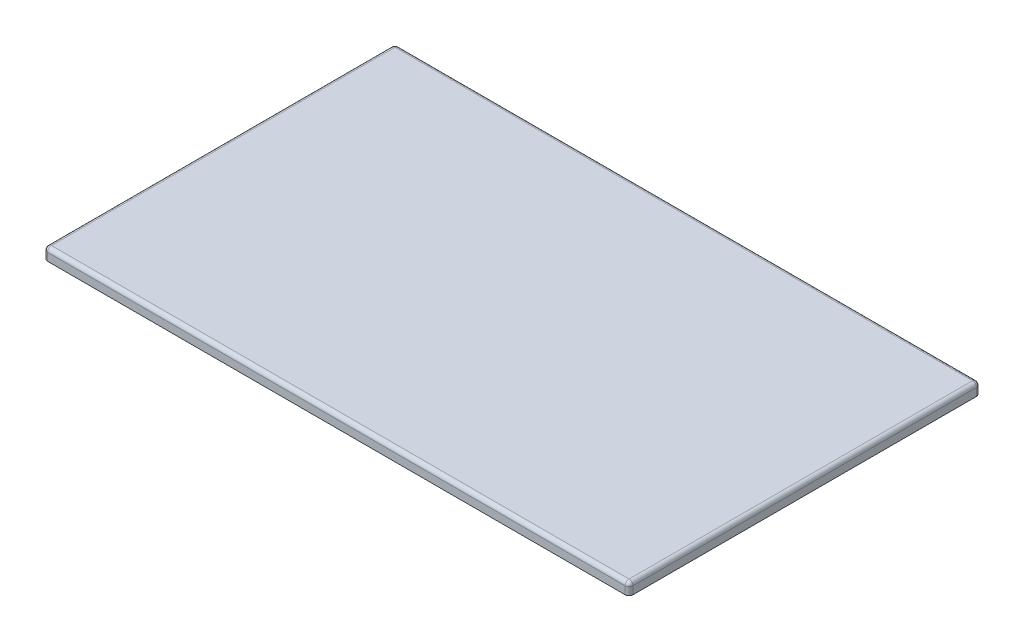
ISO-10303-21;
HEADER;
FILE_DESCRIPTION(('STEP AP214'),'2;1');
FILE_NAME('part.step','',(''),(''),'','','');
FILE_SCHEMA(('AUTOMOTIVE_DESIGN { 1 0 10303 214 1 1 1 1 }'));
ENDSEC;
DATA;
#1=APPLICATION_CONTEXT('core data for automotive mechanical design processes');
#2=APPLICATION_PROTOCOL_DEFINITION('international standard','automotive_design',2000,#1);
#3=PRODUCT_CONTEXT('',#1,'mechanical');
#4=PRODUCT('Part','Part','',(#3));
#5=PRODUCT_RELATED_PRODUCT_CATEGORY('part','',(#4));
#6=PRODUCT_DEFINITION_FORMATION('','',#4);
#7=PRODUCT_DEFINITION_CONTEXT('part definition',#1,'design');
#8=PRODUCT_DEFINITION('design','',#6,#7);
#9=PRODUCT_DEFINITION_SHAPE('','',#8);
#10=(LENGTH_UNIT() NAMED_UNIT(*) SI_UNIT(.MILLI.,.METRE.));
#11=(NAMED_UNIT(*) PLANE_ANGLE_UNIT() SI_UNIT($,.RADIAN.));
#12=(NAMED_UNIT(*) SI_UNIT($,.STERADIAN.) SOLID_ANGLE_UNIT());
#13=UNCERTAINTY_MEASURE_WITH_UNIT(LENGTH_MEASURE(1.E-05),#10,'distance_accuracy_value','');
#14=(GEOMETRIC_REPRESENTATION_CONTEXT(3) GLOBAL_UNCERTAINTY_ASSIGNED_CONTEXT((#13)) GLOBAL_UNIT_ASSIGNED_CONTEXT((#10,
#11,#12)) REPRESENTATION_CONTEXT('',''));
#15=CARTESIAN_POINT('',(0.,0.,0.));
#16=DIRECTION('',(0.,0.,1.));
#17=DIRECTION('',(1.,0.,0.));
#18=AXIS2_PLACEMENT_3D('',#15,#16,#17);
#19=CARTESIAN_POINT('',(0.,30.,0.));
#20=DIRECTION('',(1.,0.,0.));
#21=DIRECTION('',(0.,0.,-1.));
#22=AXIS2_PLACEMENT_3D('',#19,#20,#21);
#23=PLANE('',#22);
#24=DIRECTION('',(0.,0.,1.));
#25=VECTOR('',#24,1.);
#26=CARTESIAN_POINT('',(0.,20.,0.));
#27=LINE('',#26,#25);
#28=CARTESIAN_POINT('',(0.,20.,-10.));
#29=VERTEX_POINT('',#28);
#30=CARTESIAN_POINT('',(0.,20.,-890.));
#31=VERTEX_POINT('',#30);
#32=EDGE_CURVE('E442',#29,#31,#27,.F.);
#33=ORIENTED_EDGE('',*,*,#32,.T.);
#34=DIRECTION('',(0.,-1.,0.));
#35=VECTOR('',#34,1.);
#36=CARTESIAN_POINT('',(0.,30.,-890.));
#37=LINE('',#36,#35);
#38=CARTESIAN_POINT('',(0.,0.,-890.));
#39=VERTEX_POINT('',#38);
#40=EDGE_CURVE('E477',#31,#39,#37,.T.);
#41=ORIENTED_EDGE('',*,*,#40,.T.);
#42=DIRECTION('',(0.,0.,1.));
#43=VECTOR('',#42,1.);
#44=CARTESIAN_POINT('',(0.,0.,0.));
#45=LINE('',#44,#43);
#46=CARTESIAN_POINT('',(0.,0.,-10.));
#47=VERTEX_POINT('',#46);
#48=EDGE_CURVE('E397',#39,#47,#45,.T.);
#49=ORIENTED_EDGE('',*,*,#48,.T.);
#50=DIRECTION('',(0.,-1.,0.));
#51=VECTOR('',#50,1.);
#52=CARTESIAN_POINT('',(0.,30.,-10.));
#53=LINE('',#52,#51);
#54=EDGE_CURVE('E474',#47,#29,#53,.F.);
#55=ORIENTED_EDGE('',*,*,#54,.T.);
#56=EDGE_LOOP('',(#33,#41,#49,#55));
#57=FACE_BOUND('',#56,.T.);
#58=ADVANCED_FACE('F40',(#57),#23,.F.);
#59=CARTESIAN_POINT('',(0.,30.,0.));
#60=DIRECTION('',(0.,0.,-1.));
#61=DIRECTION('',(-1.,0.,0.));
#62=AXIS2_PLACEMENT_3D('',#59,#60,#61);
#63=PLANE('',#62);
#64=DIRECTION('',(1.,0.,0.));
#65=VECTOR('',#64,1.);
#66=CARTESIAN_POINT('',(0.,0.,0.));
#67=LINE('',#66,#65);
#68=CARTESIAN_POINT('',(10.,0.,0.));
#69=VERTEX_POINT('',#68);
#70=CARTESIAN_POINT('',(1490.,0.,0.));
#71=VERTEX_POINT('',#70);
#72=EDGE_CURVE('E401',#69,#71,#67,.T.);
#73=ORIENTED_EDGE('',*,*,#72,.T.);
#74=DIRECTION('',(0.,-1.,0.));
#75=VECTOR('',#74,1.);
#76=CARTESIAN_POINT('',(1490.,30.,0.));
#77=LINE('',#76,#75);
#78=CARTESIAN_POINT('',(1490.,20.,0.));
#79=VERTEX_POINT('',#78);
#80=EDGE_CURVE('E11',#71,#79,#77,.F.);
#81=ORIENTED_EDGE('',*,*,#80,.T.);
#82=DIRECTION('',(1.,0.,0.));
#83=VECTOR('',#82,1.);
#84=CARTESIAN_POINT('',(0.,20.,0.));
#85=LINE('',#84,#83);
#86=CARTESIAN_POINT('',(10.,20.,0.));
#87=VERTEX_POINT('',#86);
#88=EDGE_CURVE('E438',#79,#87,#85,.F.);
#89=ORIENTED_EDGE('',*,*,#88,.T.);
#90=DIRECTION('',(0.,-1.,0.));
#91=VECTOR('',#90,1.);
#92=CARTESIAN_POINT('',(10.,30.,0.));
#93=LINE('',#92,#91);
#94=EDGE_CURVE('E50',#87,#69,#93,.T.);
#95=ORIENTED_EDGE('',*,*,#94,.T.);
#96=EDGE_LOOP('',(#73,#81,#89,#95));
#97=FACE_BOUND('',#96,.T.);
#98=ADVANCED_FACE('F530',(#97),#63,.F.);
#99=CARTESIAN_POINT('',(1500.,30.,0.));
#100=DIRECTION('',(-1.,0.,0.));
#101=DIRECTION('',(0.,0.,1.));
#102=AXIS2_PLACEMENT_3D('',#99,#100,#101);
#103=PLANE('',#102);
#104=DIRECTION('',(0.,0.,-1.));
#105=VECTOR('',#104,1.);
#106=CARTESIAN_POINT('',(1500.,0.,0.));
#107=LINE('',#106,#105);
#108=CARTESIAN_POINT('',(1500.,0.,-10.));
#109=VERTEX_POINT('',#108);
#110=CARTESIAN_POINT('',(1500.,0.,-890.));
#111=VERTEX_POINT('',#110);
#112=EDGE_CURVE('E406',#109,#111,#107,.T.);
#113=ORIENTED_EDGE('',*,*,#112,.T.);
#114=DIRECTION('',(0.,-1.,0.));
#115=VECTOR('',#114,1.);
#116=CARTESIAN_POINT('',(1500.,30.,-890.));
#117=LINE('',#116,#115);
#118=CARTESIAN_POINT('',(1500.,20.,-890.));
#119=VERTEX_POINT('',#118);
#120=EDGE_CURVE('E501',#111,#119,#117,.F.);
#121=ORIENTED_EDGE('',*,*,#120,.T.);
#122=DIRECTION('',(0.,0.,-1.));
#123=VECTOR('',#122,1.);
#124=CARTESIAN_POINT('',(1500.,20.,0.));
#125=LINE('',#124,#123);
#126=CARTESIAN_POINT('',(1500.,20.,-10.));
#127=VERTEX_POINT('',#126);
#128=EDGE_CURVE('E434',#119,#127,#125,.F.);
#129=ORIENTED_EDGE('',*,*,#128,.T.);
#130=DIRECTION('',(0.,-1.,0.));
#131=VECTOR('',#130,1.);
#132=CARTESIAN_POINT('',(1500.,30.,-10.));
#133=LINE('',#132,#131);
#134=EDGE_CURVE('E498',#127,#109,#133,.T.);
#135=ORIENTED_EDGE('',*,*,#134,.T.);
#136=EDGE_LOOP('',(#113,#121,#129,#135));
#137=FACE_BOUND('',#136,.T.);
#138=ADVANCED_FACE('F550',(#137),#103,.F.);
#139=CARTESIAN_POINT('',(0.,30.,-900.));
#140=DIRECTION('',(0.,0.,1.));
#141=DIRECTION('',(1.,0.,0.));
#142=AXIS2_PLACEMENT_3D('',#139,#140,#141);
#143=PLANE('',#142);
#144=DIRECTION('',(-1.,0.,0.));
#145=VECTOR('',#144,1.);
#146=CARTESIAN_POINT('',(0.,0.,-900.));
#147=LINE('',#146,#145);
#148=CARTESIAN_POINT('',(1490.,0.,-900.));
#149=VERTEX_POINT('',#148);
#150=CARTESIAN_POINT('',(10.,0.,-900.));
#151=VERTEX_POINT('',#150);
#152=EDGE_CURVE('E410',#149,#151,#147,.T.);
#153=ORIENTED_EDGE('',*,*,#152,.T.);
#154=DIRECTION('',(0.,-1.,0.));
#155=VECTOR('',#154,1.);
#156=CARTESIAN_POINT('',(10.,30.,-900.));
#157=LINE('',#156,#155);
#158=CARTESIAN_POINT('',(10.,20.,-900.));
#159=VERTEX_POINT('',#158);
#160=EDGE_CURVE('E495',#151,#159,#157,.F.);
#161=ORIENTED_EDGE('',*,*,#160,.T.);
#162=DIRECTION('',(-1.,0.,0.));
#163=VECTOR('',#162,1.);
#164=CARTESIAN_POINT('',(0.,20.,-900.));
#165=LINE('',#164,#163);
#166=CARTESIAN_POINT('',(1490.,20.,-900.));
#167=VERTEX_POINT('',#166);
#168=EDGE_CURVE('E430',#159,#167,#165,.F.);
#169=ORIENTED_EDGE('',*,*,#168,.T.);
#170=DIRECTION('',(0.,-1.,0.));
#171=VECTOR('',#170,1.);
#172=CARTESIAN_POINT('',(1490.,30.,-900.));
#173=LINE('',#172,#171);
#174=EDGE_CURVE('E492',#167,#149,#173,.T.);
#175=ORIENTED_EDGE('',*,*,#174,.T.);
#176=EDGE_LOOP('',(#153,#161,#169,#175));
#177=FACE_BOUND('',#176,.T.);
#178=ADVANCED_FACE('F613',(#177),#143,.F.);
#179=CARTESIAN_POINT('',(0.,30.,0.));
#180=DIRECTION('',(0.,-1.,0.));
#181=DIRECTION('',(0.,0.,-1.));
#182=AXIS2_PLACEMENT_3D('',#179,#180,#181);
#183=PLANE('',#182);
#184=DIRECTION('',(0.,0.,-1.));
#185=VECTOR('',#184,1.);
#186=CARTESIAN_POINT('',(1490.,30.,0.));
#187=LINE('',#186,#185);
#188=CARTESIAN_POINT('',(1490.,30.,-10.));
#189=VERTEX_POINT('',#188);
#190=CARTESIAN_POINT('',(1490.,30.,-890.));
#191=VERTEX_POINT('',#190);
#192=EDGE_CURVE('E422',#189,#191,#187,.T.);
#193=ORIENTED_EDGE('',*,*,#192,.T.);
#194=DIRECTION('',(-1.,0.,0.));
#195=VECTOR('',#194,1.);
#196=CARTESIAN_POINT('',(0.,30.,-890.));
#197=LINE('',#196,#195);
#198=CARTESIAN_POINT('',(10.,30.,-890.));
#199=VERTEX_POINT('',#198);
#200=EDGE_CURVE('E426',#191,#199,#197,.T.);
#201=ORIENTED_EDGE('',*,*,#200,.T.);
#202=DIRECTION('',(0.,0.,1.));
#203=VECTOR('',#202,1.);
#204=CARTESIAN_POINT('',(10.,30.,0.));
#205=LINE('',#204,#203);
#206=CARTESIAN_POINT('',(10.,30.,-10.));
#207=VERTEX_POINT('',#206);
#208=EDGE_CURVE('E414',#199,#207,#205,.T.);
#209=ORIENTED_EDGE('',*,*,#208,.T.);
#210=DIRECTION('',(1.,0.,0.));
#211=VECTOR('',#210,1.);
#212=CARTESIAN_POINT('',(0.,30.,-10.));
#213=LINE('',#212,#211);
#214=EDGE_CURVE('E418',#207,#189,#213,.T.);
#215=ORIENTED_EDGE('',*,*,#214,.T.);
#216=EDGE_LOOP('',(#193,#201,#209,#215));
#217=FACE_BOUND('',#216,.T.);
#218=ADVANCED_FACE('F562',(#217),#183,.F.);
#219=CARTESIAN_POINT('',(0.,0.,0.));
#220=DIRECTION('',(0.,-1.,0.));
#221=DIRECTION('',(0.,0.,-1.));
#222=AXIS2_PLACEMENT_3D('',#219,#220,#221);
#223=PLANE('',#222);
#224=CARTESIAN_POINT('',(100.,0.,-800.));
#225=DIRECTION('',(0.,-1.,0.));
#226=DIRECTION('',(0.,0.,1.));
#227=AXIS2_PLACEMENT_3D('',#224,#225,#226);
#228=CIRCLE('',#227,10.);
#229=CARTESIAN_POINT('',(100.,0.,-790.));
#230=VERTEX_POINT('',#229);
#231=CARTESIAN_POINT('',(100.,0.,-810.));
#232=VERTEX_POINT('',#231);
#233=EDGE_CURVE('E58',#230,#232,#228,.T.);
#234=ORIENTED_EDGE('',*,*,#233,.F.);
#235=DIRECTION('',(-1.,0.,0.));
#236=VECTOR('',#235,1.);
#237=CARTESIAN_POINT('',(100.,0.,-790.));
#238=LINE('',#237,#236);
#239=CARTESIAN_POINT('',(150.,0.,-790.));
#240=VERTEX_POINT('',#239);
#241=EDGE_CURVE('E318',#240,#230,#238,.T.);
#242=ORIENTED_EDGE('',*,*,#241,.F.);
#243=CARTESIAN_POINT('',(150.,0.,-800.));
#244=DIRECTION('',(0.,-1.,0.));
#245=DIRECTION('',(0.,0.,1.));
#246=AXIS2_PLACEMENT_3D('',#243,#244,#245);
#247=CIRCLE('',#246,10.);
#248=CARTESIAN_POINT('',(150.,0.,-810.));
#249=VERTEX_POINT('',#248);
#250=EDGE_CURVE('E337',#249,#240,#247,.T.);
#251=ORIENTED_EDGE('',*,*,#250,.F.);
#252=DIRECTION('',(1.,0.,0.));
#253=VECTOR('',#252,1.);
#254=CARTESIAN_POINT('',(100.,0.,-810.));
#255=LINE('',#254,#253);
#256=EDGE_CURVE('E333',#232,#249,#255,.T.);
#257=ORIENTED_EDGE('',*,*,#256,.F.);
#258=EDGE_LOOP('',(#234,#242,#251,#257));
#259=FACE_BOUND('',#258,.T.);
#260=CARTESIAN_POINT('',(1400.,0.,-800.));
#261=DIRECTION('',(0.,-1.,0.));
#262=DIRECTION('',(0.,0.,-1.));
#263=AXIS2_PLACEMENT_3D('',#260,#261,#262);
#264=CIRCLE('',#263,10.);
#265=CARTESIAN_POINT('',(1400.,0.,-810.));
#266=VERTEX_POINT('',#265);
#267=CARTESIAN_POINT('',(1400.,0.,-790.));
#268=VERTEX_POINT('',#267);
#269=EDGE_CURVE('E66',#266,#268,#264,.T.);
#270=ORIENTED_EDGE('',*,*,#269,.F.);
#271=DIRECTION('',(1.,0.,0.));
#272=VECTOR('',#271,1.);
#273=CARTESIAN_POINT('',(1400.,0.,-810.));
#274=LINE('',#273,#272);
#275=CARTESIAN_POINT('',(1350.,0.,-810.));
#276=VERTEX_POINT('',#275);
#277=EDGE_CURVE('E276',#276,#266,#274,.T.);
#278=ORIENTED_EDGE('',*,*,#277,.F.);
#279=CARTESIAN_POINT('',(1350.,0.,-800.));
#280=DIRECTION('',(0.,-1.,0.));
#281=DIRECTION('',(0.,0.,-1.));
#282=AXIS2_PLACEMENT_3D('',#279,#280,#281);
#283=CIRCLE('',#282,10.);
#284=CARTESIAN_POINT('',(1350.,0.,-790.));
#285=VERTEX_POINT('',#284);
#286=EDGE_CURVE('E296',#285,#276,#283,.T.);
#287=ORIENTED_EDGE('',*,*,#286,.F.);
#288=DIRECTION('',(-1.,0.,0.));
#289=VECTOR('',#288,1.);
#290=CARTESIAN_POINT('',(1400.,0.,-790.));
#291=LINE('',#290,#289);
#292=EDGE_CURVE('E291',#268,#285,#291,.T.);
#293=ORIENTED_EDGE('',*,*,#292,.F.);
#294=EDGE_LOOP('',(#270,#278,#287,#293));
#295=FACE_BOUND('',#294,.T.);
#296=CARTESIAN_POINT('',(1400.,0.,-100.));
#297=DIRECTION('',(0.,-1.,0.));
#298=DIRECTION('',(0.,0.,1.));
#299=AXIS2_PLACEMENT_3D('',#296,#297,#298);
#300=CIRCLE('',#299,10.);
#301=CARTESIAN_POINT('',(1400.,0.,-110.));
#302=VERTEX_POINT('',#301);
#303=CARTESIAN_POINT('',(1400.,0.,-90.));
#304=VERTEX_POINT('',#303);
#305=EDGE_CURVE('E222',#302,#304,#300,.T.);
#306=ORIENTED_EDGE('',*,*,#305,.F.);
#307=DIRECTION('',(1.,0.,0.));
#308=VECTOR('',#307,1.);
#309=CARTESIAN_POINT('',(1400.,0.,-110.));
#310=LINE('',#309,#308);
#311=CARTESIAN_POINT('',(1350.,0.,-110.));
#312=VERTEX_POINT('',#311);
#313=EDGE_CURVE('E242',#312,#302,#310,.T.);
#314=ORIENTED_EDGE('',*,*,#313,.F.);
#315=CARTESIAN_POINT('',(1350.,0.,-100.));
#316=DIRECTION('',(0.,-1.,0.));
#317=DIRECTION('',(0.,0.,1.));
#318=AXIS2_PLACEMENT_3D('',#315,#316,#317);
#319=CIRCLE('',#318,10.);
#320=CARTESIAN_POINT('',(1350.,0.,-90.));
#321=VERTEX_POINT('',#320);
#322=EDGE_CURVE('E246',#321,#312,#319,.T.);
#323=ORIENTED_EDGE('',*,*,#322,.F.);
#324=DIRECTION('',(-1.,0.,0.));
#325=VECTOR('',#324,1.);
#326=CARTESIAN_POINT('',(1400.,0.,-90.));
#327=LINE('',#326,#325);
#328=EDGE_CURVE('E255',#304,#321,#327,.T.);
#329=ORIENTED_EDGE('',*,*,#328,.F.);
#330=EDGE_LOOP('',(#306,#314,#323,#329));
#331=FACE_BOUND('',#330,.T.);
#332=CARTESIAN_POINT('',(100.,0.,-100.));
#333=DIRECTION('',(0.,-1.,0.));
#334=DIRECTION('',(0.,0.,-1.));
#335=AXIS2_PLACEMENT_3D('',#332,#333,#334);
#336=CIRCLE('',#335,10.);
#337=CARTESIAN_POINT('',(100.,0.,-90.));
#338=VERTEX_POINT('',#337);
#339=CARTESIAN_POINT('',(100.,0.,-110.));
#340=VERTEX_POINT('',#339);
#341=EDGE_CURVE('E265',#338,#340,#336,.T.);
#342=ORIENTED_EDGE('',*,*,#341,.F.);
#343=DIRECTION('',(-1.,0.,0.));
#344=VECTOR('',#343,1.);
#345=CARTESIAN_POINT('',(100.,0.,-90.));
#346=LINE('',#345,#344);
#347=CARTESIAN_POINT('',(150.,0.,-90.));
#348=VERTEX_POINT('',#347);
#349=EDGE_CURVE('E359',#348,#338,#346,.T.);
#350=ORIENTED_EDGE('',*,*,#349,.F.);
#351=CARTESIAN_POINT('',(150.,0.,-100.));
#352=DIRECTION('',(0.,-1.,0.));
#353=DIRECTION('',(0.,0.,-1.));
#354=AXIS2_PLACEMENT_3D('',#351,#352,#353);
#355=CIRCLE('',#354,10.);
#356=CARTESIAN_POINT('',(150.,0.,-110.));
#357=VERTEX_POINT('',#356);
#358=EDGE_CURVE('E378',#357,#348,#355,.T.);
#359=ORIENTED_EDGE('',*,*,#358,.F.);
#360=DIRECTION('',(1.,0.,0.));
#361=VECTOR('',#360,1.);
#362=CARTESIAN_POINT('',(100.,0.,-110.));
#363=LINE('',#362,#361);
#364=EDGE_CURVE('E374',#340,#357,#363,.T.);
#365=ORIENTED_EDGE('',*,*,#364,.F.);
#366=EDGE_LOOP('',(#342,#350,#359,#365));
#367=FACE_BOUND('',#366,.T.);
#368=ORIENTED_EDGE('',*,*,#48,.F.);
#369=CARTESIAN_POINT('',(10.,0.,-890.));
#370=DIRECTION('',(0.,-1.,0.));
#371=DIRECTION('',(0.,0.,-1.));
#372=AXIS2_PLACEMENT_3D('',#369,#370,#371);
#373=CIRCLE('',#372,10.);
#374=EDGE_CURVE('E489',#39,#151,#373,.T.);
#375=ORIENTED_EDGE('',*,*,#374,.T.);
#376=ORIENTED_EDGE('',*,*,#152,.F.);
#377=CARTESIAN_POINT('',(1490.,0.,-890.));
#378=DIRECTION('',(0.,-1.,0.));
#379=DIRECTION('',(0.,0.,-1.));
#380=AXIS2_PLACEMENT_3D('',#377,#378,#379);
#381=CIRCLE('',#380,10.);
#382=EDGE_CURVE('E486',#149,#111,#381,.T.);
#383=ORIENTED_EDGE('',*,*,#382,.T.);
#384=ORIENTED_EDGE('',*,*,#112,.F.);
#385=CARTESIAN_POINT('',(1490.,0.,-10.));
#386=DIRECTION('',(0.,-1.,0.));
#387=DIRECTION('',(0.,0.,-1.));
#388=AXIS2_PLACEMENT_3D('',#385,#386,#387);
#389=CIRCLE('',#388,10.);
#390=EDGE_CURVE('E483',#109,#71,#389,.T.);
#391=ORIENTED_EDGE('',*,*,#390,.T.);
#392=ORIENTED_EDGE('',*,*,#72,.F.);
#393=CARTESIAN_POINT('',(10.,0.,-10.));
#394=DIRECTION('',(0.,-1.,0.));
#395=DIRECTION('',(0.,0.,-1.));
#396=AXIS2_PLACEMENT_3D('',#393,#394,#395);
#397=CIRCLE('',#396,10.);
#398=EDGE_CURVE('E480',#69,#47,#397,.T.);
#399=ORIENTED_EDGE('',*,*,#398,.T.);
#400=EDGE_LOOP('',(#368,#375,#376,#383,#384,#391,#392,#399));
#401=FACE_BOUND('',#400,.T.);
#402=ADVANCED_FACE('F535',(#259,#295,#331,#367,#401),#223,.T.);
#403=CARTESIAN_POINT('',(0.,20.,-10.));
#404=DIRECTION('',(1.,0.,0.));
#405=DIRECTION('',(0.,0.,-1.));
#406=AXIS2_PLACEMENT_3D('',#403,#404,#405);
#407=CYLINDRICAL_SURFACE('',#406,10.);
#408=ORIENTED_EDGE('',*,*,#88,.F.);
#409=CARTESIAN_POINT('',(1490.,20.,-10.));
#410=DIRECTION('',(1.,0.,0.));
#411=DIRECTION('',(0.,0.,-1.));
#412=AXIS2_PLACEMENT_3D('',#409,#410,#411);
#413=CIRCLE('',#412,10.);
#414=EDGE_CURVE('E471',#79,#189,#413,.F.);
#415=ORIENTED_EDGE('',*,*,#414,.T.);
#416=ORIENTED_EDGE('',*,*,#214,.F.);
#417=CARTESIAN_POINT('',(10.,20.,-10.));
#418=DIRECTION('',(1.,0.,0.));
#419=DIRECTION('',(0.,0.,-1.));
#420=AXIS2_PLACEMENT_3D('',#417,#418,#419);
#421=CIRCLE('',#420,10.);
#422=EDGE_CURVE('E468',#207,#87,#421,.T.);
#423=ORIENTED_EDGE('',*,*,#422,.T.);
#424=EDGE_LOOP('',(#408,#415,#416,#423));
#425=FACE_BOUND('',#424,.T.);
#426=ADVANCED_FACE('F541',(#425),#407,.T.);
#427=CARTESIAN_POINT('',(1490.,20.,0.));
#428=DIRECTION('',(0.,0.,-1.));
#429=DIRECTION('',(-1.,0.,0.));
#430=AXIS2_PLACEMENT_3D('',#427,#428,#429);
#431=CYLINDRICAL_SURFACE('',#430,10.);
#432=ORIENTED_EDGE('',*,*,#128,.F.);
#433=CARTESIAN_POINT('',(1490.,20.,-890.));
#434=DIRECTION('',(0.,0.,-1.));
#435=DIRECTION('',(-1.,0.,0.));
#436=AXIS2_PLACEMENT_3D('',#433,#434,#435);
#437=CIRCLE('',#436,10.);
#438=EDGE_CURVE('E465',#119,#191,#437,.F.);
#439=ORIENTED_EDGE('',*,*,#438,.T.);
#440=ORIENTED_EDGE('',*,*,#192,.F.);
#441=CARTESIAN_POINT('',(1490.,20.,-10.));
#442=DIRECTION('',(0.,0.,-1.));
#443=DIRECTION('',(-1.,0.,0.));
#444=AXIS2_PLACEMENT_3D('',#441,#442,#443);
#445=CIRCLE('',#444,10.);
#446=EDGE_CURVE('E461',#189,#127,#445,.T.);
#447=ORIENTED_EDGE('',*,*,#446,.T.);
#448=EDGE_LOOP('',(#432,#439,#440,#447));
#449=FACE_BOUND('',#448,.T.);
#450=ADVANCED_FACE('F547',(#449),#431,.T.);
#451=CARTESIAN_POINT('',(10.,20.,0.));
#452=DIRECTION('',(0.,0.,1.));
#453=DIRECTION('',(1.,0.,0.));
#454=AXIS2_PLACEMENT_3D('',#451,#452,#453);
#455=CYLINDRICAL_SURFACE('',#454,10.);
#456=ORIENTED_EDGE('',*,*,#208,.F.);
#457=CARTESIAN_POINT('',(10.,20.,-890.));
#458=DIRECTION('',(0.,0.,1.));
#459=DIRECTION('',(1.,0.,0.));
#460=AXIS2_PLACEMENT_3D('',#457,#458,#459);
#461=CIRCLE('',#460,10.);
#462=EDGE_CURVE('E458',#199,#31,#461,.T.);
#463=ORIENTED_EDGE('',*,*,#462,.T.);
#464=ORIENTED_EDGE('',*,*,#32,.F.);
#465=CARTESIAN_POINT('',(10.,20.,-10.));
#466=DIRECTION('',(0.,0.,1.));
#467=DIRECTION('',(1.,0.,0.));
#468=AXIS2_PLACEMENT_3D('',#465,#466,#467);
#469=CIRCLE('',#468,10.);
#470=EDGE_CURVE('E454',#29,#207,#469,.F.);
#471=ORIENTED_EDGE('',*,*,#470,.T.);
#472=EDGE_LOOP('',(#456,#463,#464,#471));
#473=FACE_BOUND('',#472,.T.);
#474=ADVANCED_FACE('F571',(#473),#455,.T.);
#475=CARTESIAN_POINT('',(0.,20.,-890.));
#476=DIRECTION('',(-1.,0.,0.));
#477=DIRECTION('',(0.,0.,1.));
#478=AXIS2_PLACEMENT_3D('',#475,#476,#477);
#479=CYLINDRICAL_SURFACE('',#478,10.);
#480=ORIENTED_EDGE('',*,*,#168,.F.);
#481=CARTESIAN_POINT('',(10.,20.,-890.));
#482=DIRECTION('',(-1.,0.,0.));
#483=DIRECTION('',(0.,0.,1.));
#484=AXIS2_PLACEMENT_3D('',#481,#482,#483);
#485=CIRCLE('',#484,10.);
#486=EDGE_CURVE('E450',#159,#199,#485,.F.);
#487=ORIENTED_EDGE('',*,*,#486,.T.);
#488=ORIENTED_EDGE('',*,*,#200,.F.);
#489=CARTESIAN_POINT('',(1490.,20.,-890.));
#490=DIRECTION('',(-1.,0.,0.));
#491=DIRECTION('',(0.,0.,1.));
#492=AXIS2_PLACEMENT_3D('',#489,#490,#491);
#493=CIRCLE('',#492,10.);
#494=EDGE_CURVE('E446',#191,#167,#493,.T.);
#495=ORIENTED_EDGE('',*,*,#494,.T.);
#496=EDGE_LOOP('',(#480,#487,#488,#495));
#497=FACE_BOUND('',#496,.T.);
#498=ADVANCED_FACE('F565',(#497),#479,.T.);
#499=CARTESIAN_POINT('',(10.,30.,-890.));
#500=DIRECTION('',(0.,-1.,0.));
#501=DIRECTION('',(0.,0.,-1.));
#502=AXIS2_PLACEMENT_3D('',#499,#500,#501);
#503=CYLINDRICAL_SURFACE('',#502,10.);
#504=ORIENTED_EDGE('',*,*,#374,.F.);
#505=ORIENTED_EDGE('',*,*,#40,.F.);
#506=CARTESIAN_POINT('',(10.,20.,-890.));
#507=DIRECTION('',(0.,1.,0.));
#508=DIRECTION('',(0.,0.,1.));
#509=AXIS2_PLACEMENT_3D('',#506,#507,#508);
#510=CIRCLE('',#509,10.);
#511=EDGE_CURVE('E402',#159,#31,#510,.T.);
#512=ORIENTED_EDGE('',*,*,#511,.F.);
#513=ORIENTED_EDGE('',*,*,#160,.F.);
#514=EDGE_LOOP('',(#504,#505,#512,#513));
#515=FACE_BOUND('',#514,.T.);
#516=ADVANCED_FACE('F577',(#515),#503,.T.);
#517=CARTESIAN_POINT('',(10.,20.,-890.));
#518=DIRECTION('',(0.,0.,1.));
#519=DIRECTION('',(1.,0.,0.));
#520=AXIS2_PLACEMENT_3D('',#517,#518,#519);
#521=SPHERICAL_SURFACE('',#520,10.);
#522=ORIENTED_EDGE('',*,*,#511,.T.);
#523=ORIENTED_EDGE('',*,*,#462,.F.);
#524=ORIENTED_EDGE('',*,*,#486,.F.);
#525=EDGE_LOOP('',(#522,#523,#524));
#526=FACE_BOUND('',#525,.T.);
#527=ADVANCED_FACE('F579',(#526),#521,.T.);
#528=CARTESIAN_POINT('',(1490.,30.,-890.));
#529=DIRECTION('',(0.,-1.,0.));
#530=DIRECTION('',(0.,0.,-1.));
#531=AXIS2_PLACEMENT_3D('',#528,#529,#530);
#532=CYLINDRICAL_SURFACE('',#531,10.);
#533=ORIENTED_EDGE('',*,*,#382,.F.);
#534=ORIENTED_EDGE('',*,*,#174,.F.);
#535=CARTESIAN_POINT('',(1490.,20.,-890.));
#536=DIRECTION('',(0.,1.,0.));
#537=DIRECTION('',(0.,0.,1.));
#538=AXIS2_PLACEMENT_3D('',#535,#536,#537);
#539=CIRCLE('',#538,10.);
#540=EDGE_CURVE('E509',#119,#167,#539,.T.);
#541=ORIENTED_EDGE('',*,*,#540,.F.);
#542=ORIENTED_EDGE('',*,*,#120,.F.);
#543=EDGE_LOOP('',(#533,#534,#541,#542));
#544=FACE_BOUND('',#543,.T.);
#545=ADVANCED_FACE('F555',(#544),#532,.T.);
#546=CARTESIAN_POINT('',(1490.,20.,-890.));
#547=DIRECTION('',(0.,0.,1.));
#548=DIRECTION('',(1.,0.,0.));
#549=AXIS2_PLACEMENT_3D('',#546,#547,#548);
#550=SPHERICAL_SURFACE('',#549,10.);
#551=ORIENTED_EDGE('',*,*,#494,.F.);
#552=ORIENTED_EDGE('',*,*,#438,.F.);
#553=ORIENTED_EDGE('',*,*,#540,.T.);
#554=EDGE_LOOP('',(#551,#552,#553));
#555=FACE_BOUND('',#554,.T.);
#556=ADVANCED_FACE('F559',(#555),#550,.T.);
#557=CARTESIAN_POINT('',(1490.,30.,-10.));
#558=DIRECTION('',(0.,-1.,0.));
#559=DIRECTION('',(0.,0.,-1.));
#560=AXIS2_PLACEMENT_3D('',#557,#558,#559);
#561=CYLINDRICAL_SURFACE('',#560,10.);
#562=ORIENTED_EDGE('',*,*,#390,.F.);
#563=ORIENTED_EDGE('',*,*,#134,.F.);
#564=CARTESIAN_POINT('',(1490.,20.,-10.));
#565=DIRECTION('',(0.,1.,0.));
#566=DIRECTION('',(0.,0.,1.));
#567=AXIS2_PLACEMENT_3D('',#564,#565,#566);
#568=CIRCLE('',#567,10.);
#569=EDGE_CURVE('E511',#79,#127,#568,.T.);
#570=ORIENTED_EDGE('',*,*,#569,.F.);
#571=ORIENTED_EDGE('',*,*,#80,.F.);
#572=EDGE_LOOP('',(#562,#563,#570,#571));
#573=FACE_BOUND('',#572,.T.);
#574=ADVANCED_FACE('F539',(#573),#561,.T.);
#575=CARTESIAN_POINT('',(1490.,20.,-10.));
#576=DIRECTION('',(0.,0.,1.));
#577=DIRECTION('',(1.,0.,0.));
#578=AXIS2_PLACEMENT_3D('',#575,#576,#577);
#579=SPHERICAL_SURFACE('',#578,10.);
#580=ORIENTED_EDGE('',*,*,#446,.F.);
#581=ORIENTED_EDGE('',*,*,#414,.F.);
#582=ORIENTED_EDGE('',*,*,#569,.T.);
#583=EDGE_LOOP('',(#580,#581,#582));
#584=FACE_BOUND('',#583,.T.);
#585=ADVANCED_FACE('F543',(#584),#579,.T.);
#586=CARTESIAN_POINT('',(10.,30.,-10.));
#587=DIRECTION('',(0.,-1.,0.));
#588=DIRECTION('',(0.,0.,-1.));
#589=AXIS2_PLACEMENT_3D('',#586,#587,#588);
#590=CYLINDRICAL_SURFACE('',#589,10.);
#591=ORIENTED_EDGE('',*,*,#398,.F.);
#592=ORIENTED_EDGE('',*,*,#94,.F.);
#593=CARTESIAN_POINT('',(10.,20.,-10.));
#594=DIRECTION('',(0.,1.,0.));
#595=DIRECTION('',(0.,0.,1.));
#596=AXIS2_PLACEMENT_3D('',#593,#594,#595);
#597=CIRCLE('',#596,10.);
#598=EDGE_CURVE('E44',#29,#87,#597,.T.);
#599=ORIENTED_EDGE('',*,*,#598,.F.);
#600=ORIENTED_EDGE('',*,*,#54,.F.);
#601=EDGE_LOOP('',(#591,#592,#599,#600));
#602=FACE_BOUND('',#601,.T.);
#603=ADVANCED_FACE('F42',(#602),#590,.T.);
#604=CARTESIAN_POINT('',(10.,20.,-10.));
#605=DIRECTION('',(0.,0.,1.));
#606=DIRECTION('',(1.,0.,0.));
#607=AXIS2_PLACEMENT_3D('',#604,#605,#606);
#608=SPHERICAL_SURFACE('',#607,10.);
#609=ORIENTED_EDGE('',*,*,#598,.T.);
#610=ORIENTED_EDGE('',*,*,#422,.F.);
#611=ORIENTED_EDGE('',*,*,#470,.F.);
#612=EDGE_LOOP('',(#609,#610,#611));
#613=FACE_BOUND('',#612,.T.);
#614=ADVANCED_FACE('F523',(#613),#608,.T.);
#615=CARTESIAN_POINT('',(100.,15.,-100.));
#616=DIRECTION('',(0.,-1.,0.));
#617=DIRECTION('',(0.,0.,-1.));
#618=AXIS2_PLACEMENT_3D('',#615,#616,#617);
#619=CYLINDRICAL_SURFACE('',#618,10.);
#620=ORIENTED_EDGE('',*,*,#341,.T.);
#621=DIRECTION('',(0.,-1.,0.));
#622=VECTOR('',#621,1.);
#623=CARTESIAN_POINT('',(100.,15.,-110.));
#624=LINE('',#623,#622);
#625=CARTESIAN_POINT('',(100.,15.,-110.));
#626=VERTEX_POINT('',#625);
#627=EDGE_CURVE('E371',#626,#340,#624,.T.);
#628=ORIENTED_EDGE('',*,*,#627,.F.);
#629=CARTESIAN_POINT('',(100.,15.,-100.));
#630=DIRECTION('',(0.,-1.,0.));
#631=DIRECTION('',(0.,0.,-1.));
#632=AXIS2_PLACEMENT_3D('',#629,#630,#631);
#633=CIRCLE('',#632,10.);
#634=CARTESIAN_POINT('',(100.,15.,-90.));
#635=VERTEX_POINT('',#634);
#636=EDGE_CURVE('E354',#635,#626,#633,.T.);
#637=ORIENTED_EDGE('',*,*,#636,.F.);
#638=DIRECTION('',(0.,-1.,0.));
#639=VECTOR('',#638,1.);
#640=CARTESIAN_POINT('',(100.,15.,-90.));
#641=LINE('',#640,#639);
#642=EDGE_CURVE('E385',#635,#338,#641,.T.);
#643=ORIENTED_EDGE('',*,*,#642,.T.);
#644=EDGE_LOOP('',(#620,#628,#637,#643));
#645=FACE_BOUND('',#644,.T.);
#646=ADVANCED_FACE('F713',(#645),#619,.F.);
#647=CARTESIAN_POINT('',(100.,15.,-90.));
#648=DIRECTION('',(0.,0.,1.));
#649=DIRECTION('',(1.,0.,0.));
#650=AXIS2_PLACEMENT_3D('',#647,#648,#649);
#651=PLANE('',#650);
#652=ORIENTED_EDGE('',*,*,#349,.T.);
#653=ORIENTED_EDGE('',*,*,#642,.F.);
#654=DIRECTION('',(-1.,0.,0.));
#655=VECTOR('',#654,1.);
#656=CARTESIAN_POINT('',(100.,15.,-90.));
#657=LINE('',#656,#655);
#658=CARTESIAN_POINT('',(150.,15.,-90.));
#659=VERTEX_POINT('',#658);
#660=EDGE_CURVE('E367',#659,#635,#657,.T.);
#661=ORIENTED_EDGE('',*,*,#660,.F.);
#662=DIRECTION('',(0.,-1.,0.));
#663=VECTOR('',#662,1.);
#664=CARTESIAN_POINT('',(150.,15.,-90.));
#665=LINE('',#664,#663);
#666=EDGE_CURVE('E388',#659,#348,#665,.T.);
#667=ORIENTED_EDGE('',*,*,#666,.T.);
#668=EDGE_LOOP('',(#652,#653,#661,#667));
#669=FACE_BOUND('',#668,.T.);
#670=ADVANCED_FACE('F720',(#669),#651,.F.);
#671=CARTESIAN_POINT('',(150.,15.,-100.));
#672=DIRECTION('',(0.,-1.,0.));
#673=DIRECTION('',(0.,0.,-1.));
#674=AXIS2_PLACEMENT_3D('',#671,#672,#673);
#675=CYLINDRICAL_SURFACE('',#674,10.);
#676=ORIENTED_EDGE('',*,*,#358,.T.);
#677=ORIENTED_EDGE('',*,*,#666,.F.);
#678=CARTESIAN_POINT('',(150.,15.,-100.));
#679=DIRECTION('',(0.,-1.,0.));
#680=DIRECTION('',(0.,0.,-1.));
#681=AXIS2_PLACEMENT_3D('',#678,#679,#680);
#682=CIRCLE('',#681,10.);
#683=CARTESIAN_POINT('',(150.,15.,-110.));
#684=VERTEX_POINT('',#683);
#685=EDGE_CURVE('E363',#684,#659,#682,.T.);
#686=ORIENTED_EDGE('',*,*,#685,.F.);
#687=DIRECTION('',(0.,-1.,0.));
#688=VECTOR('',#687,1.);
#689=CARTESIAN_POINT('',(150.,15.,-110.));
#690=LINE('',#689,#688);
#691=EDGE_CURVE('E391',#684,#357,#690,.T.);
#692=ORIENTED_EDGE('',*,*,#691,.T.);
#693=EDGE_LOOP('',(#676,#677,#686,#692));
#694=FACE_BOUND('',#693,.T.);
#695=ADVANCED_FACE('F728',(#694),#675,.F.);
#696=CARTESIAN_POINT('',(100.,15.,-110.));
#697=DIRECTION('',(0.,0.,-1.));
#698=DIRECTION('',(-1.,0.,0.));
#699=AXIS2_PLACEMENT_3D('',#696,#697,#698);
#700=PLANE('',#699);
#701=ORIENTED_EDGE('',*,*,#364,.T.);
#702=ORIENTED_EDGE('',*,*,#691,.F.);
#703=DIRECTION('',(1.,0.,0.));
#704=VECTOR('',#703,1.);
#705=CARTESIAN_POINT('',(100.,15.,-110.));
#706=LINE('',#705,#704);
#707=EDGE_CURVE('E358',#626,#684,#706,.T.);
#708=ORIENTED_EDGE('',*,*,#707,.F.);
#709=ORIENTED_EDGE('',*,*,#627,.T.);
#710=EDGE_LOOP('',(#701,#702,#708,#709));
#711=FACE_BOUND('',#710,.T.);
#712=ADVANCED_FACE('F737',(#711),#700,.F.);
#713=CARTESIAN_POINT('',(100.,15.,-100.));
#714=DIRECTION('',(0.,-1.,0.));
#715=DIRECTION('',(0.,0.,-1.));
#716=AXIS2_PLACEMENT_3D('',#713,#714,#715);
#717=PLANE('',#716);
#718=ORIENTED_EDGE('',*,*,#636,.T.);
#719=ORIENTED_EDGE('',*,*,#707,.T.);
#720=ORIENTED_EDGE('',*,*,#685,.T.);
#721=ORIENTED_EDGE('',*,*,#660,.T.);
#722=EDGE_LOOP('',(#718,#719,#720,#721));
#723=FACE_BOUND('',#722,.T.);
#724=ADVANCED_FACE('F746',(#723),#717,.T.);
#725=CARTESIAN_POINT('',(1400.,15.,-100.));
#726=DIRECTION('',(0.,-1.,0.));
#727=DIRECTION('',(0.,0.,-1.));
#728=AXIS2_PLACEMENT_3D('',#725,#726,#727);
#729=CYLINDRICAL_SURFACE('',#728,10.);
#730=ORIENTED_EDGE('',*,*,#305,.T.);
#731=DIRECTION('',(0.,-1.,0.));
#732=VECTOR('',#731,1.);
#733=CARTESIAN_POINT('',(1400.,15.,-90.));
#734=LINE('',#733,#732);
#735=CARTESIAN_POINT('',(1400.,15.,-90.));
#736=VERTEX_POINT('',#735);
#737=EDGE_CURVE('E215',#736,#304,#734,.T.);
#738=ORIENTED_EDGE('',*,*,#737,.F.);
#739=CARTESIAN_POINT('',(1400.,15.,-100.));
#740=DIRECTION('',(0.,-1.,0.));
#741=DIRECTION('',(0.,0.,1.));
#742=AXIS2_PLACEMENT_3D('',#739,#740,#741);
#743=CIRCLE('',#742,10.);
#744=CARTESIAN_POINT('',(1400.,15.,-110.));
#745=VERTEX_POINT('',#744);
#746=EDGE_CURVE('E219',#745,#736,#743,.T.);
#747=ORIENTED_EDGE('',*,*,#746,.F.);
#748=DIRECTION('',(0.,-1.,0.));
#749=VECTOR('',#748,1.);
#750=CARTESIAN_POINT('',(1400.,15.,-110.));
#751=LINE('',#750,#749);
#752=EDGE_CURVE('E262',#745,#302,#751,.T.);
#753=ORIENTED_EDGE('',*,*,#752,.T.);
#754=EDGE_LOOP('',(#730,#738,#747,#753));
#755=FACE_BOUND('',#754,.T.);
#756=ADVANCED_FACE('F217',(#755),#729,.F.);
#757=CARTESIAN_POINT('',(1400.,15.,-110.));
#758=DIRECTION('',(0.,0.,-1.));
#759=DIRECTION('',(-1.,0.,0.));
#760=AXIS2_PLACEMENT_3D('',#757,#758,#759);
#761=PLANE('',#760);
#762=ORIENTED_EDGE('',*,*,#313,.T.);
#763=ORIENTED_EDGE('',*,*,#752,.F.);
#764=DIRECTION('',(1.,0.,0.));
#765=VECTOR('',#764,1.);
#766=CARTESIAN_POINT('',(1400.,15.,-110.));
#767=LINE('',#766,#765);
#768=CARTESIAN_POINT('',(1350.,15.,-110.));
#769=VERTEX_POINT('',#768);
#770=EDGE_CURVE('E228',#769,#745,#767,.T.);
#771=ORIENTED_EDGE('',*,*,#770,.F.);
#772=DIRECTION('',(0.,-1.,0.));
#773=VECTOR('',#772,1.);
#774=CARTESIAN_POINT('',(1350.,15.,-110.));
#775=LINE('',#774,#773);
#776=EDGE_CURVE('E266',#769,#312,#775,.T.);
#777=ORIENTED_EDGE('',*,*,#776,.T.);
#778=EDGE_LOOP('',(#762,#763,#771,#777));
#779=FACE_BOUND('',#778,.T.);
#780=ADVANCED_FACE('F763',(#779),#761,.F.);
#781=CARTESIAN_POINT('',(1350.,15.,-100.));
#782=DIRECTION('',(0.,-1.,0.));
#783=DIRECTION('',(0.,0.,-1.));
#784=AXIS2_PLACEMENT_3D('',#781,#782,#783);
#785=CYLINDRICAL_SURFACE('',#784,10.);
#786=ORIENTED_EDGE('',*,*,#322,.T.);
#787=ORIENTED_EDGE('',*,*,#776,.F.);
#788=CARTESIAN_POINT('',(1350.,15.,-100.));
#789=DIRECTION('',(0.,-1.,0.));
#790=DIRECTION('',(0.,0.,1.));
#791=AXIS2_PLACEMENT_3D('',#788,#789,#790);
#792=CIRCLE('',#791,10.);
#793=CARTESIAN_POINT('',(1350.,15.,-90.));
#794=VERTEX_POINT('',#793);
#795=EDGE_CURVE('E237',#794,#769,#792,.T.);
#796=ORIENTED_EDGE('',*,*,#795,.F.);
#797=DIRECTION('',(0.,-1.,0.));
#798=VECTOR('',#797,1.);
#799=CARTESIAN_POINT('',(1350.,15.,-90.));
#800=LINE('',#799,#798);
#801=EDGE_CURVE('E227',#794,#321,#800,.T.);
#802=ORIENTED_EDGE('',*,*,#801,.T.);
#803=EDGE_LOOP('',(#786,#787,#796,#802));
#804=FACE_BOUND('',#803,.T.);
#805=ADVANCED_FACE('F771',(#804),#785,.F.);
#806=CARTESIAN_POINT('',(1400.,15.,-90.));
#807=DIRECTION('',(0.,0.,1.));
#808=DIRECTION('',(1.,0.,0.));
#809=AXIS2_PLACEMENT_3D('',#806,#807,#808);
#810=PLANE('',#809);
#811=ORIENTED_EDGE('',*,*,#328,.T.);
#812=ORIENTED_EDGE('',*,*,#801,.F.);
#813=DIRECTION('',(-1.,0.,0.));
#814=VECTOR('',#813,1.);
#815=CARTESIAN_POINT('',(1400.,15.,-90.));
#816=LINE('',#815,#814);
#817=EDGE_CURVE('E231',#736,#794,#816,.T.);
#818=ORIENTED_EDGE('',*,*,#817,.F.);
#819=ORIENTED_EDGE('',*,*,#737,.T.);
#820=EDGE_LOOP('',(#811,#812,#818,#819));
#821=FACE_BOUND('',#820,.T.);
#822=ADVANCED_FACE('F232',(#821),#810,.F.);
#823=CARTESIAN_POINT('',(1400.,15.,-100.));
#824=DIRECTION('',(0.,1.,0.));
#825=DIRECTION('',(0.,0.,1.));
#826=AXIS2_PLACEMENT_3D('',#823,#824,#825);
#827=PLANE('',#826);
#828=ORIENTED_EDGE('',*,*,#746,.T.);
#829=ORIENTED_EDGE('',*,*,#817,.T.);
#830=ORIENTED_EDGE('',*,*,#795,.T.);
#831=ORIENTED_EDGE('',*,*,#770,.T.);
#832=EDGE_LOOP('',(#828,#829,#830,#831));
#833=FACE_BOUND('',#832,.T.);
#834=ADVANCED_FACE('F239',(#833),#827,.F.);
#835=CARTESIAN_POINT('',(1400.,15.,-800.));
#836=DIRECTION('',(0.,-1.,0.));
#837=DIRECTION('',(0.,0.,-1.));
#838=AXIS2_PLACEMENT_3D('',#835,#836,#837);
#839=CYLINDRICAL_SURFACE('',#838,10.);
#840=ORIENTED_EDGE('',*,*,#269,.T.);
#841=DIRECTION('',(0.,-1.,0.));
#842=VECTOR('',#841,1.);
#843=CARTESIAN_POINT('',(1400.,15.,-790.));
#844=LINE('',#843,#842);
#845=CARTESIAN_POINT('',(1400.,15.,-790.));
#846=VERTEX_POINT('',#845);
#847=EDGE_CURVE('E288',#846,#268,#844,.T.);
#848=ORIENTED_EDGE('',*,*,#847,.F.);
#849=CARTESIAN_POINT('',(1400.,15.,-800.));
#850=DIRECTION('',(0.,-1.,0.));
#851=DIRECTION('',(0.,0.,-1.));
#852=AXIS2_PLACEMENT_3D('',#849,#850,#851);
#853=CIRCLE('',#852,10.);
#854=CARTESIAN_POINT('',(1400.,15.,-810.));
#855=VERTEX_POINT('',#854);
#856=EDGE_CURVE('E271',#855,#846,#853,.T.);
#857=ORIENTED_EDGE('',*,*,#856,.F.);
#858=DIRECTION('',(0.,-1.,0.));
#859=VECTOR('',#858,1.);
#860=CARTESIAN_POINT('',(1400.,15.,-810.));
#861=LINE('',#860,#859);
#862=EDGE_CURVE('E256',#855,#266,#861,.T.);
#863=ORIENTED_EDGE('',*,*,#862,.T.);
#864=EDGE_LOOP('',(#840,#848,#857,#863));
#865=FACE_BOUND('',#864,.T.);
#866=ADVANCED_FACE('F795',(#865),#839,.F.);
#867=CARTESIAN_POINT('',(1400.,15.,-810.));
#868=DIRECTION('',(0.,0.,-1.));
#869=DIRECTION('',(-1.,0.,0.));
#870=AXIS2_PLACEMENT_3D('',#867,#868,#869);
#871=PLANE('',#870);
#872=ORIENTED_EDGE('',*,*,#277,.T.);
#873=ORIENTED_EDGE('',*,*,#862,.F.);
#874=DIRECTION('',(1.,0.,0.));
#875=VECTOR('',#874,1.);
#876=CARTESIAN_POINT('',(1400.,15.,-810.));
#877=LINE('',#876,#875);
#878=CARTESIAN_POINT('',(1350.,15.,-810.));
#879=VERTEX_POINT('',#878);
#880=EDGE_CURVE('E284',#879,#855,#877,.T.);
#881=ORIENTED_EDGE('',*,*,#880,.F.);
#882=DIRECTION('',(0.,-1.,0.));
#883=VECTOR('',#882,1.);
#884=CARTESIAN_POINT('',(1350.,15.,-810.));
#885=LINE('',#884,#883);
#886=EDGE_CURVE('E305',#879,#276,#885,.T.);
#887=ORIENTED_EDGE('',*,*,#886,.T.);
#888=EDGE_LOOP('',(#872,#873,#881,#887));
#889=FACE_BOUND('',#888,.T.);
#890=ADVANCED_FACE('F803',(#889),#871,.F.);
#891=CARTESIAN_POINT('',(1350.,15.,-800.));
#892=DIRECTION('',(0.,-1.,0.));
#893=DIRECTION('',(0.,0.,-1.));
#894=AXIS2_PLACEMENT_3D('',#891,#892,#893);
#895=CYLINDRICAL_SURFACE('',#894,10.);
#896=ORIENTED_EDGE('',*,*,#286,.T.);
#897=ORIENTED_EDGE('',*,*,#886,.F.);
#898=CARTESIAN_POINT('',(1350.,15.,-800.));
#899=DIRECTION('',(0.,-1.,0.));
#900=DIRECTION('',(0.,0.,-1.));
#901=AXIS2_PLACEMENT_3D('',#898,#899,#900);
#902=CIRCLE('',#901,10.);
#903=CARTESIAN_POINT('',(1350.,15.,-790.));
#904=VERTEX_POINT('',#903);
#905=EDGE_CURVE('E280',#904,#879,#902,.T.);
#906=ORIENTED_EDGE('',*,*,#905,.F.);
#907=DIRECTION('',(0.,-1.,0.));
#908=VECTOR('',#907,1.);
#909=CARTESIAN_POINT('',(1350.,15.,-790.));
#910=LINE('',#909,#908);
#911=EDGE_CURVE('E308',#904,#285,#910,.T.);
#912=ORIENTED_EDGE('',*,*,#911,.T.);
#913=EDGE_LOOP('',(#896,#897,#906,#912));
#914=FACE_BOUND('',#913,.T.);
#915=ADVANCED_FACE('F811',(#914),#895,.F.);
#916=CARTESIAN_POINT('',(1400.,15.,-790.));
#917=DIRECTION('',(0.,0.,1.));
#918=DIRECTION('',(1.,0.,0.));
#919=AXIS2_PLACEMENT_3D('',#916,#917,#918);
#920=PLANE('',#919);
#921=ORIENTED_EDGE('',*,*,#292,.T.);
#922=ORIENTED_EDGE('',*,*,#911,.F.);
#923=DIRECTION('',(-1.,0.,0.));
#924=VECTOR('',#923,1.);
#925=CARTESIAN_POINT('',(1400.,15.,-790.));
#926=LINE('',#925,#924);
#927=EDGE_CURVE('E275',#846,#904,#926,.T.);
#928=ORIENTED_EDGE('',*,*,#927,.F.);
#929=ORIENTED_EDGE('',*,*,#847,.T.);
#930=EDGE_LOOP('',(#921,#922,#928,#929));
#931=FACE_BOUND('',#930,.T.);
#932=ADVANCED_FACE('F820',(#931),#920,.F.);
#933=CARTESIAN_POINT('',(1400.,15.,-800.));
#934=DIRECTION('',(0.,-1.,0.));
#935=DIRECTION('',(0.,0.,-1.));
#936=AXIS2_PLACEMENT_3D('',#933,#934,#935);
#937=PLANE('',#936);
#938=ORIENTED_EDGE('',*,*,#856,.T.);
#939=ORIENTED_EDGE('',*,*,#927,.T.);
#940=ORIENTED_EDGE('',*,*,#905,.T.);
#941=ORIENTED_EDGE('',*,*,#880,.T.);
#942=EDGE_LOOP('',(#938,#939,#940,#941));
#943=FACE_BOUND('',#942,.T.);
#944=ADVANCED_FACE('F829',(#943),#937,.T.);
#945=CARTESIAN_POINT('',(100.,15.,-800.));
#946=DIRECTION('',(0.,-1.,0.));
#947=DIRECTION('',(0.,0.,-1.));
#948=AXIS2_PLACEMENT_3D('',#945,#946,#947);
#949=CYLINDRICAL_SURFACE('',#948,10.);
#950=ORIENTED_EDGE('',*,*,#233,.T.);
#951=DIRECTION('',(0.,-1.,0.));
#952=VECTOR('',#951,1.);
#953=CARTESIAN_POINT('',(100.,15.,-810.));
#954=LINE('',#953,#952);
#955=CARTESIAN_POINT('',(100.,15.,-810.));
#956=VERTEX_POINT('',#955);
#957=EDGE_CURVE('E330',#956,#232,#954,.T.);
#958=ORIENTED_EDGE('',*,*,#957,.F.);
#959=CARTESIAN_POINT('',(100.,15.,-800.));
#960=DIRECTION('',(0.,-1.,0.));
#961=DIRECTION('',(0.,0.,1.));
#962=AXIS2_PLACEMENT_3D('',#959,#960,#961);
#963=CIRCLE('',#962,10.);
#964=CARTESIAN_POINT('',(100.,15.,-790.));
#965=VERTEX_POINT('',#964);
#966=EDGE_CURVE('E313',#965,#956,#963,.T.);
#967=ORIENTED_EDGE('',*,*,#966,.F.);
#968=DIRECTION('',(0.,-1.,0.));
#969=VECTOR('',#968,1.);
#970=CARTESIAN_POINT('',(100.,15.,-790.));
#971=LINE('',#970,#969);
#972=EDGE_CURVE('E292',#965,#230,#971,.T.);
#973=ORIENTED_EDGE('',*,*,#972,.T.);
#974=EDGE_LOOP('',(#950,#958,#967,#973));
#975=FACE_BOUND('',#974,.T.);
#976=ADVANCED_FACE('F838',(#975),#949,.F.);
#977=CARTESIAN_POINT('',(100.,15.,-790.));
#978=DIRECTION('',(0.,0.,1.));
#979=DIRECTION('',(1.,0.,0.));
#980=AXIS2_PLACEMENT_3D('',#977,#978,#979);
#981=PLANE('',#980);
#982=ORIENTED_EDGE('',*,*,#241,.T.);
#983=ORIENTED_EDGE('',*,*,#972,.F.);
#984=DIRECTION('',(-1.,0.,0.));
#985=VECTOR('',#984,1.);
#986=CARTESIAN_POINT('',(100.,15.,-790.));
#987=LINE('',#986,#985);
#988=CARTESIAN_POINT('',(150.,15.,-790.));
#989=VERTEX_POINT('',#988);
#990=EDGE_CURVE('E326',#989,#965,#987,.T.);
#991=ORIENTED_EDGE('',*,*,#990,.F.);
#992=DIRECTION('',(0.,-1.,0.));
#993=VECTOR('',#992,1.);
#994=CARTESIAN_POINT('',(150.,15.,-790.));
#995=LINE('',#994,#993);
#996=EDGE_CURVE('E346',#989,#240,#995,.T.);
#997=ORIENTED_EDGE('',*,*,#996,.T.);
#998=EDGE_LOOP('',(#982,#983,#991,#997));
#999=FACE_BOUND('',#998,.T.);
#1000=ADVANCED_FACE('F847',(#999),#981,.F.);
#1001=CARTESIAN_POINT('',(150.,15.,-800.));
#1002=DIRECTION('',(0.,-1.,0.));
#1003=DIRECTION('',(0.,0.,-1.));
#1004=AXIS2_PLACEMENT_3D('',#1001,#1002,#1003);
#1005=CYLINDRICAL_SURFACE('',#1004,10.);
#1006=ORIENTED_EDGE('',*,*,#250,.T.);
#1007=ORIENTED_EDGE('',*,*,#996,.F.);
#1008=CARTESIAN_POINT('',(150.,15.,-800.));
#1009=DIRECTION('',(0.,-1.,0.));
#1010=DIRECTION('',(0.,0.,1.));
#1011=AXIS2_PLACEMENT_3D('',#1008,#1009,#1010);
#1012=CIRCLE('',#1011,10.);
#1013=CARTESIAN_POINT('',(150.,15.,-810.));
#1014=VERTEX_POINT('',#1013);
#1015=EDGE_CURVE('E322',#1014,#989,#1012,.T.);
#1016=ORIENTED_EDGE('',*,*,#1015,.F.);
#1017=DIRECTION('',(0.,-1.,0.));
#1018=VECTOR('',#1017,1.);
#1019=CARTESIAN_POINT('',(150.,15.,-810.));
#1020=LINE('',#1019,#1018);
#1021=EDGE_CURVE('E349',#1014,#249,#1020,.T.);
#1022=ORIENTED_EDGE('',*,*,#1021,.T.);
#1023=EDGE_LOOP('',(#1006,#1007,#1016,#1022));
#1024=FACE_BOUND('',#1023,.T.);
#1025=ADVANCED_FACE('F855',(#1024),#1005,.F.);
#1026=CARTESIAN_POINT('',(100.,15.,-810.));
#1027=DIRECTION('',(0.,0.,-1.));
#1028=DIRECTION('',(-1.,0.,0.));
#1029=AXIS2_PLACEMENT_3D('',#1026,#1027,#1028);
#1030=PLANE('',#1029);
#1031=ORIENTED_EDGE('',*,*,#256,.T.);
#1032=ORIENTED_EDGE('',*,*,#1021,.F.);
#1033=DIRECTION('',(1.,0.,0.));
#1034=VECTOR('',#1033,1.);
#1035=CARTESIAN_POINT('',(100.,15.,-810.));
#1036=LINE('',#1035,#1034);
#1037=EDGE_CURVE('E317',#956,#1014,#1036,.T.);
#1038=ORIENTED_EDGE('',*,*,#1037,.F.);
#1039=ORIENTED_EDGE('',*,*,#957,.T.);
#1040=EDGE_LOOP('',(#1031,#1032,#1038,#1039));
#1041=FACE_BOUND('',#1040,.T.);
#1042=ADVANCED_FACE('F864',(#1041),#1030,.F.);
#1043=CARTESIAN_POINT('',(100.,15.,-800.));
#1044=DIRECTION('',(0.,1.,0.));
#1045=DIRECTION('',(0.,0.,1.));
#1046=AXIS2_PLACEMENT_3D('',#1043,#1044,#1045);
#1047=PLANE('',#1046);
#1048=ORIENTED_EDGE('',*,*,#966,.T.);
#1049=ORIENTED_EDGE('',*,*,#1037,.T.);
#1050=ORIENTED_EDGE('',*,*,#1015,.T.);
#1051=ORIENTED_EDGE('',*,*,#990,.T.);
#1052=EDGE_LOOP('',(#1048,#1049,#1050,#1051));
#1053=FACE_BOUND('',#1052,.T.);
#1054=ADVANCED_FACE('F873',(#1053),#1047,.F.);
#1055=CLOSED_SHELL('',(#58,#98,#138,#178,#218,#402,#426,#450,#474,#498,#516,#527,#545,#556,#574,
#585,#603,#614,#646,#670,#695,#712,#724,#756,#780,#805,#822,#834,#866,#890,#915,#932,#944,#976,
#1000,#1025,#1042,#1054));
#1056=MANIFOLD_SOLID_BREP('B2',#1055);
#1057=ADVANCED_BREP_SHAPE_REPRESENTATION('',(#18,#1056),#14);
#1058=SHAPE_DEFINITION_REPRESENTATION(#9,#1057);
ENDSEC;
END-ISO-10303-21;
